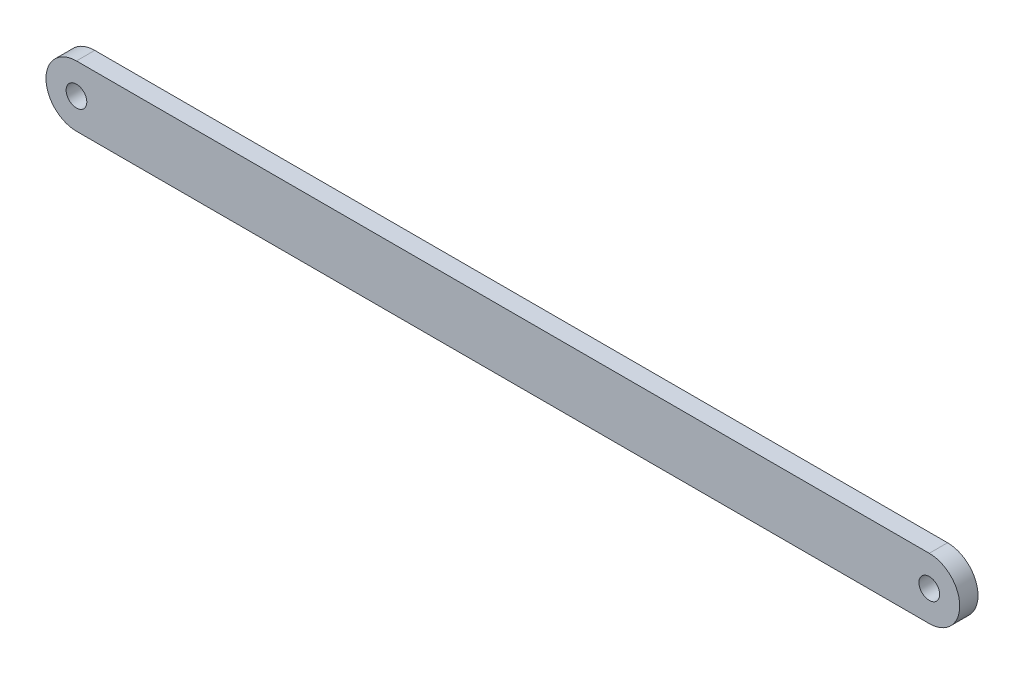
ISO-10303-21;
HEADER;
FILE_DESCRIPTION(('STEP AP214'),'2;1');
FILE_NAME('part.step','',(''),(''),'','','');
FILE_SCHEMA(('AUTOMOTIVE_DESIGN { 1 0 10303 214 1 1 1 1 }'));
ENDSEC;
DATA;
#1=APPLICATION_CONTEXT('core data for automotive mechanical design processes');
#2=APPLICATION_PROTOCOL_DEFINITION('international standard','automotive_design',2000,#1);
#3=PRODUCT_CONTEXT('',#1,'mechanical');
#4=PRODUCT('Part','Part','',(#3));
#5=PRODUCT_RELATED_PRODUCT_CATEGORY('part','',(#4));
#6=PRODUCT_DEFINITION_FORMATION('','',#4);
#7=PRODUCT_DEFINITION_CONTEXT('part definition',#1,'design');
#8=PRODUCT_DEFINITION('design','',#6,#7);
#9=PRODUCT_DEFINITION_SHAPE('','',#8);
#10=(LENGTH_UNIT() NAMED_UNIT(*) SI_UNIT(.MILLI.,.METRE.));
#11=(NAMED_UNIT(*) PLANE_ANGLE_UNIT() SI_UNIT($,.RADIAN.));
#12=(NAMED_UNIT(*) SI_UNIT($,.STERADIAN.) SOLID_ANGLE_UNIT());
#13=UNCERTAINTY_MEASURE_WITH_UNIT(LENGTH_MEASURE(1.E-05),#10,'distance_accuracy_value','');
#14=(GEOMETRIC_REPRESENTATION_CONTEXT(3) GLOBAL_UNCERTAINTY_ASSIGNED_CONTEXT((#13)) GLOBAL_UNIT_ASSIGNED_CONTEXT((#10,
#11,#12)) REPRESENTATION_CONTEXT('',''));
#15=CARTESIAN_POINT('',(0.,0.,0.));
#16=DIRECTION('',(0.,0.,1.));
#17=DIRECTION('',(1.,0.,0.));
#18=AXIS2_PLACEMENT_3D('',#15,#16,#17);
#19=CARTESIAN_POINT('',(-70.,0.,1.5));
#20=DIRECTION('',(0.,0.,-1.));
#21=DIRECTION('',(-1.,0.,0.));
#22=AXIS2_PLACEMENT_3D('',#19,#20,#21);
#23=CYLINDRICAL_SURFACE('',#22,5.);
#24=CARTESIAN_POINT('',(-70.,0.,-1.5));
#25=DIRECTION('',(0.,0.,1.));
#26=DIRECTION('',(1.,0.,0.));
#27=AXIS2_PLACEMENT_3D('',#24,#25,#26);
#28=CIRCLE('',#27,5.);
#29=CARTESIAN_POINT('',(-70.,4.99999999999999,-1.5));
#30=VERTEX_POINT('',#29);
#31=CARTESIAN_POINT('',(-70.,-5.00000000000001,-1.5));
#32=VERTEX_POINT('',#31);
#33=EDGE_CURVE('E100',#30,#32,#28,.T.);
#34=ORIENTED_EDGE('',*,*,#33,.T.);
#35=DIRECTION('',(0.,0.,-1.));
#36=VECTOR('',#35,1.);
#37=CARTESIAN_POINT('',(-70.,-5.00000000000001,1.5));
#38=LINE('',#37,#36);
#39=CARTESIAN_POINT('',(-70.,-5.00000000000001,1.5));
#40=VERTEX_POINT('',#39);
#41=EDGE_CURVE('E11',#40,#32,#38,.T.);
#42=ORIENTED_EDGE('',*,*,#41,.F.);
#43=CARTESIAN_POINT('',(-70.,0.,1.5));
#44=DIRECTION('',(0.,0.,1.));
#45=DIRECTION('',(1.,0.,0.));
#46=AXIS2_PLACEMENT_3D('',#43,#44,#45);
#47=CIRCLE('',#46,5.);
#48=CARTESIAN_POINT('',(-70.,4.99999999999999,1.5));
#49=VERTEX_POINT('',#48);
#50=EDGE_CURVE('E88',#49,#40,#47,.T.);
#51=ORIENTED_EDGE('',*,*,#50,.F.);
#52=DIRECTION('',(0.,0.,-1.));
#53=VECTOR('',#52,1.);
#54=CARTESIAN_POINT('',(-70.,4.99999999999999,1.5));
#55=LINE('',#54,#53);
#56=EDGE_CURVE('E96',#49,#30,#55,.T.);
#57=ORIENTED_EDGE('',*,*,#56,.T.);
#58=EDGE_LOOP('',(#34,#42,#51,#57));
#59=FACE_BOUND('',#58,.T.);
#60=ADVANCED_FACE('F37',(#59),#23,.T.);
#61=CARTESIAN_POINT('',(-70.,-5.00000000000001,1.5));
#62=DIRECTION('',(0.,1.,0.));
#63=DIRECTION('',(0.,0.,1.));
#64=AXIS2_PLACEMENT_3D('',#61,#62,#63);
#65=PLANE('',#64);
#66=DIRECTION('',(1.,0.,0.));
#67=VECTOR('',#66,1.);
#68=CARTESIAN_POINT('',(-70.,-5.00000000000001,-1.5));
#69=LINE('',#68,#67);
#70=CARTESIAN_POINT('',(70.,-4.99999999999999,-1.5));
#71=VERTEX_POINT('',#70);
#72=EDGE_CURVE('E92',#32,#71,#69,.T.);
#73=ORIENTED_EDGE('',*,*,#72,.T.);
#74=DIRECTION('',(0.,0.,-1.));
#75=VECTOR('',#74,1.);
#76=CARTESIAN_POINT('',(70.,-4.99999999999999,1.5));
#77=LINE('',#76,#75);
#78=CARTESIAN_POINT('',(70.,-4.99999999999999,1.5));
#79=VERTEX_POINT('',#78);
#80=EDGE_CURVE('E45',#79,#71,#77,.T.);
#81=ORIENTED_EDGE('',*,*,#80,.F.);
#82=DIRECTION('',(1.,0.,0.));
#83=VECTOR('',#82,1.);
#84=CARTESIAN_POINT('',(-70.,-5.00000000000001,1.5));
#85=LINE('',#84,#83);
#86=EDGE_CURVE('E83',#40,#79,#85,.T.);
#87=ORIENTED_EDGE('',*,*,#86,.F.);
#88=ORIENTED_EDGE('',*,*,#41,.T.);
#89=EDGE_LOOP('',(#73,#81,#87,#88));
#90=FACE_BOUND('',#89,.T.);
#91=ADVANCED_FACE('F91',(#90),#65,.F.);
#92=CARTESIAN_POINT('',(70.,0.,1.5));
#93=DIRECTION('',(0.,0.,-1.));
#94=DIRECTION('',(-1.,0.,0.));
#95=AXIS2_PLACEMENT_3D('',#92,#93,#94);
#96=CYLINDRICAL_SURFACE('',#95,5.);
#97=CARTESIAN_POINT('',(70.,0.,-1.5));
#98=DIRECTION('',(0.,0.,1.));
#99=DIRECTION('',(1.,0.,0.));
#100=AXIS2_PLACEMENT_3D('',#97,#98,#99);
#101=CIRCLE('',#100,5.);
#102=CARTESIAN_POINT('',(70.,4.99999999999999,-1.5));
#103=VERTEX_POINT('',#102);
#104=EDGE_CURVE('E70',#71,#103,#101,.T.);
#105=ORIENTED_EDGE('',*,*,#104,.T.);
#106=DIRECTION('',(0.,0.,-1.));
#107=VECTOR('',#106,1.);
#108=CARTESIAN_POINT('',(70.,4.99999999999999,1.5));
#109=LINE('',#108,#107);
#110=CARTESIAN_POINT('',(70.,4.99999999999999,1.5));
#111=VERTEX_POINT('',#110);
#112=EDGE_CURVE('E93',#111,#103,#109,.T.);
#113=ORIENTED_EDGE('',*,*,#112,.F.);
#114=CARTESIAN_POINT('',(70.,0.,1.5));
#115=DIRECTION('',(0.,0.,1.));
#116=DIRECTION('',(1.,0.,0.));
#117=AXIS2_PLACEMENT_3D('',#114,#115,#116);
#118=CIRCLE('',#117,5.);
#119=EDGE_CURVE('E86',#79,#111,#118,.T.);
#120=ORIENTED_EDGE('',*,*,#119,.F.);
#121=ORIENTED_EDGE('',*,*,#80,.T.);
#122=EDGE_LOOP('',(#105,#113,#120,#121));
#123=FACE_BOUND('',#122,.T.);
#124=ADVANCED_FACE('F94',(#123),#96,.T.);
#125=CARTESIAN_POINT('',(-70.,4.99999999999999,1.5));
#126=DIRECTION('',(0.,-1.,0.));
#127=DIRECTION('',(0.,0.,-1.));
#128=AXIS2_PLACEMENT_3D('',#125,#126,#127);
#129=PLANE('',#128);
#130=DIRECTION('',(-1.,0.,0.));
#131=VECTOR('',#130,1.);
#132=CARTESIAN_POINT('',(-70.,4.99999999999999,-1.5));
#133=LINE('',#132,#131);
#134=EDGE_CURVE('E76',#103,#30,#133,.T.);
#135=ORIENTED_EDGE('',*,*,#134,.T.);
#136=ORIENTED_EDGE('',*,*,#56,.F.);
#137=DIRECTION('',(-1.,0.,0.));
#138=VECTOR('',#137,1.);
#139=CARTESIAN_POINT('',(-70.,4.99999999999999,1.5));
#140=LINE('',#139,#138);
#141=EDGE_CURVE('E53',#111,#49,#140,.T.);
#142=ORIENTED_EDGE('',*,*,#141,.F.);
#143=ORIENTED_EDGE('',*,*,#112,.T.);
#144=EDGE_LOOP('',(#135,#136,#142,#143));
#145=FACE_BOUND('',#144,.T.);
#146=ADVANCED_FACE('F108',(#145),#129,.F.);
#147=CARTESIAN_POINT('',(-70.,0.,1.5));
#148=DIRECTION('',(0.,0.,1.));
#149=DIRECTION('',(1.,0.,0.));
#150=AXIS2_PLACEMENT_3D('',#147,#148,#149);
#151=PLANE('',#150);
#152=CARTESIAN_POINT('',(-70.,0.,1.5));
#153=DIRECTION('',(0.,0.,1.));
#154=DIRECTION('',(1.,0.,0.));
#155=AXIS2_PLACEMENT_3D('',#152,#153,#154);
#156=CIRCLE('',#155,1.69999999999999);
#157=CARTESIAN_POINT('',(-68.3,0.,1.5));
#158=VERTEX_POINT('',#157);
#159=EDGE_CURVE('E122',#158,#158,#156,.T.);
#160=ORIENTED_EDGE('',*,*,#159,.F.);
#161=EDGE_LOOP('',(#160));
#162=FACE_BOUND('',#161,.T.);
#163=CARTESIAN_POINT('',(70.,0.,1.5));
#164=DIRECTION('',(0.,0.,1.));
#165=DIRECTION('',(1.,0.,0.));
#166=AXIS2_PLACEMENT_3D('',#163,#164,#165);
#167=CIRCLE('',#166,1.69999999999999);
#168=CARTESIAN_POINT('',(71.7,0.,1.5));
#169=VERTEX_POINT('',#168);
#170=EDGE_CURVE('E116',#169,#169,#167,.T.);
#171=ORIENTED_EDGE('',*,*,#170,.F.);
#172=EDGE_LOOP('',(#171));
#173=FACE_BOUND('',#172,.T.);
#174=ORIENTED_EDGE('',*,*,#50,.T.);
#175=ORIENTED_EDGE('',*,*,#86,.T.);
#176=ORIENTED_EDGE('',*,*,#119,.T.);
#177=ORIENTED_EDGE('',*,*,#141,.T.);
#178=EDGE_LOOP('',(#174,#175,#176,#177));
#179=FACE_BOUND('',#178,.T.);
#180=ADVANCED_FACE('F84',(#162,#173,#179),#151,.T.);
#181=CARTESIAN_POINT('',(-70.,0.,-1.5));
#182=DIRECTION('',(0.,0.,1.));
#183=DIRECTION('',(1.,0.,0.));
#184=AXIS2_PLACEMENT_3D('',#181,#182,#183);
#185=PLANE('',#184);
#186=CARTESIAN_POINT('',(-70.,0.,-1.5));
#187=DIRECTION('',(0.,0.,1.));
#188=DIRECTION('',(1.,0.,0.));
#189=AXIS2_PLACEMENT_3D('',#186,#187,#188);
#190=CIRCLE('',#189,1.69999999999999);
#191=CARTESIAN_POINT('',(-68.3,0.,-1.5));
#192=VERTEX_POINT('',#191);
#193=EDGE_CURVE('E119',#192,#192,#190,.T.);
#194=ORIENTED_EDGE('',*,*,#193,.T.);
#195=EDGE_LOOP('',(#194));
#196=FACE_BOUND('',#195,.T.);
#197=CARTESIAN_POINT('',(70.,0.,-1.5));
#198=DIRECTION('',(0.,0.,1.));
#199=DIRECTION('',(1.,0.,0.));
#200=AXIS2_PLACEMENT_3D('',#197,#198,#199);
#201=CIRCLE('',#200,1.69999999999999);
#202=CARTESIAN_POINT('',(71.7,0.,-1.5));
#203=VERTEX_POINT('',#202);
#204=EDGE_CURVE('E103',#203,#203,#201,.T.);
#205=ORIENTED_EDGE('',*,*,#204,.T.);
#206=EDGE_LOOP('',(#205));
#207=FACE_BOUND('',#206,.T.);
#208=ORIENTED_EDGE('',*,*,#33,.F.);
#209=ORIENTED_EDGE('',*,*,#134,.F.);
#210=ORIENTED_EDGE('',*,*,#104,.F.);
#211=ORIENTED_EDGE('',*,*,#72,.F.);
#212=EDGE_LOOP('',(#208,#209,#210,#211));
#213=FACE_BOUND('',#212,.T.);
#214=ADVANCED_FACE('F111',(#196,#207,#213),#185,.F.);
#215=CARTESIAN_POINT('',(70.,0.,1.5));
#216=DIRECTION('',(0.,0.,1.));
#217=DIRECTION('',(1.,0.,0.));
#218=AXIS2_PLACEMENT_3D('',#215,#216,#217);
#219=CYLINDRICAL_SURFACE('',#218,1.69999999999999);
#220=ORIENTED_EDGE('',*,*,#204,.F.);
#221=EDGE_LOOP('',(#220));
#222=FACE_BOUND('',#221,.T.);
#223=ORIENTED_EDGE('',*,*,#170,.T.);
#224=EDGE_LOOP('',(#223));
#225=FACE_BOUND('',#224,.T.);
#226=ADVANCED_FACE('F133',(#222,#225),#219,.F.);
#227=CARTESIAN_POINT('',(-70.,0.,1.5));
#228=DIRECTION('',(0.,0.,1.));
#229=DIRECTION('',(1.,0.,0.));
#230=AXIS2_PLACEMENT_3D('',#227,#228,#229);
#231=CYLINDRICAL_SURFACE('',#230,1.69999999999999);
#232=ORIENTED_EDGE('',*,*,#193,.F.);
#233=EDGE_LOOP('',(#232));
#234=FACE_BOUND('',#233,.T.);
#235=ORIENTED_EDGE('',*,*,#159,.T.);
#236=EDGE_LOOP('',(#235));
#237=FACE_BOUND('',#236,.T.);
#238=ADVANCED_FACE('F126',(#234,#237),#231,.F.);
#239=CLOSED_SHELL('',(#60,#91,#124,#146,#180,#214,#226,#238));
#240=MANIFOLD_SOLID_BREP('B2',#239);
#241=ADVANCED_BREP_SHAPE_REPRESENTATION('',(#18,#240),#14);
#242=SHAPE_DEFINITION_REPRESENTATION(#9,#241);
ENDSEC;
END-ISO-10303-21;
